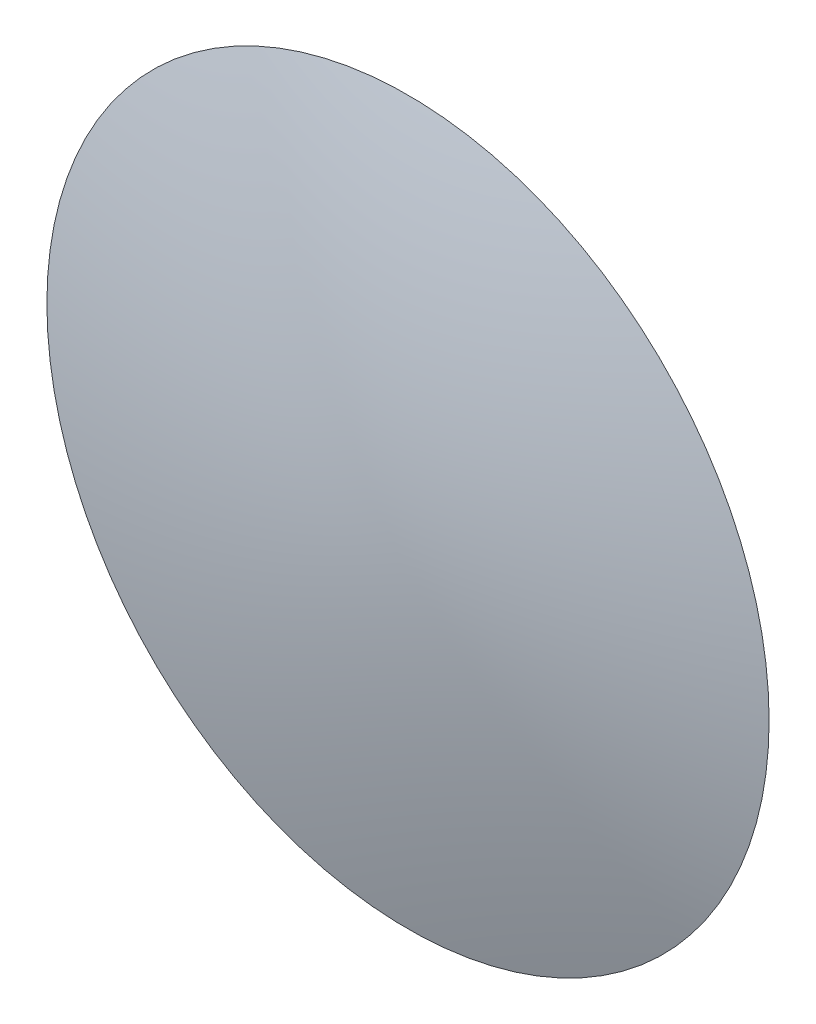
ISO-10303-21;
HEADER;
FILE_DESCRIPTION(('STEP AP214'),'2;1');
FILE_NAME('part.step','',(''),(''),'','','');
FILE_SCHEMA(('AUTOMOTIVE_DESIGN { 1 0 10303 214 1 1 1 1 }'));
ENDSEC;
DATA;
#1=APPLICATION_CONTEXT('core data for automotive mechanical design processes');
#2=APPLICATION_PROTOCOL_DEFINITION('international standard','automotive_design',2000,#1);
#3=PRODUCT_CONTEXT('',#1,'mechanical');
#4=PRODUCT('Part','Part','',(#3));
#5=PRODUCT_RELATED_PRODUCT_CATEGORY('part','',(#4));
#6=PRODUCT_DEFINITION_FORMATION('','',#4);
#7=PRODUCT_DEFINITION_CONTEXT('part definition',#1,'design');
#8=PRODUCT_DEFINITION('design','',#6,#7);
#9=PRODUCT_DEFINITION_SHAPE('','',#8);
#10=(LENGTH_UNIT() NAMED_UNIT(*) SI_UNIT(.MILLI.,.METRE.));
#11=(NAMED_UNIT(*) PLANE_ANGLE_UNIT() SI_UNIT($,.RADIAN.));
#12=(NAMED_UNIT(*) SI_UNIT($,.STERADIAN.) SOLID_ANGLE_UNIT());
#13=UNCERTAINTY_MEASURE_WITH_UNIT(LENGTH_MEASURE(1.E-05),#10,'distance_accuracy_value','');
#14=(GEOMETRIC_REPRESENTATION_CONTEXT(3) GLOBAL_UNCERTAINTY_ASSIGNED_CONTEXT((#13)) GLOBAL_UNIT_ASSIGNED_CONTEXT((#10,
#11,#12)) REPRESENTATION_CONTEXT('',''));
#15=CARTESIAN_POINT('',(0.,0.,0.));
#16=DIRECTION('',(0.,0.,1.));
#17=DIRECTION('',(1.,0.,0.));
#18=AXIS2_PLACEMENT_3D('',#15,#16,#17);
#19=CARTESIAN_POINT('',(0.,0.,-2.5));
#20=CARTESIAN_POINT('',(-6.25000000000022,0.,-2.50000000000009));
#21=CARTESIAN_POINT('',(-15.,0.,0.));
#22=B_SPLINE_CURVE_WITH_KNOTS('',2,(#19,#20,#21),.UNSPECIFIED.,.F.,.F.,(3,3),(0.,
0.500000000000018),.UNSPECIFIED.);
#23=CARTESIAN_POINT('',(0.,0.,-2.5));
#24=DIRECTION('',(0.,0.,-1.));
#25=AXIS1_PLACEMENT('',#23,#24);
#26=SURFACE_OF_REVOLUTION('',#22,#25);
#27=CARTESIAN_POINT('',(0.,0.,0.));
#28=DIRECTION('',(0.,0.,-1.));
#29=DIRECTION('',(-1.,0.,0.));
#30=AXIS2_PLACEMENT_3D('',#27,#28,#29);
#31=CIRCLE('',#30,15.);
#32=CARTESIAN_POINT('',(-15.,0.,0.));
#33=VERTEX_POINT('',#32);
#34=EDGE_CURVE('E11',#33,#33,#31,.T.);
#35=ORIENTED_EDGE('',*,*,#34,.T.);
#36=EDGE_LOOP('',(#35));
#37=FACE_BOUND('',#36,.T.);
#38=CARTESIAN_POINT('',(0.,0.,-2.5));
#39=VERTEX_POINT('',#38);
#40=VERTEX_LOOP('',#39);
#41=FACE_BOUND('',#40,.T.);
#42=ADVANCED_FACE('F39',(#37,#41),#26,.F.);
#43=CARTESIAN_POINT('',(-15.,0.,0.));
#44=CARTESIAN_POINT('',(-6.24999999999977,0.,2.49999999999991));
#45=CARTESIAN_POINT('',(0.,0.,2.5));
#46=B_SPLINE_CURVE_WITH_KNOTS('',2,(#43,#44,#45),.UNSPECIFIED.,.F.,.F.,(3,3),(0.500000000000018,
1.),.UNSPECIFIED.);
#47=CARTESIAN_POINT('',(0.,0.,-2.5));
#48=DIRECTION('',(0.,0.,-1.));
#49=AXIS1_PLACEMENT('',#47,#48);
#50=SURFACE_OF_REVOLUTION('',#46,#49);
#51=CARTESIAN_POINT('',(0.,0.,2.5));
#52=VERTEX_POINT('',#51);
#53=VERTEX_LOOP('',#52);
#54=FACE_BOUND('',#53,.T.);
#55=ORIENTED_EDGE('',*,*,#34,.F.);
#56=EDGE_LOOP('',(#55));
#57=FACE_BOUND('',#56,.T.);
#58=ADVANCED_FACE('F53',(#54,#57),#50,.F.);
#59=CLOSED_SHELL('',(#42,#58));
#60=MANIFOLD_SOLID_BREP('B2',#59);
#61=ADVANCED_BREP_SHAPE_REPRESENTATION('',(#18,#60),#14);
#62=SHAPE_DEFINITION_REPRESENTATION(#9,#61);
ENDSEC;
END-ISO-10303-21;
